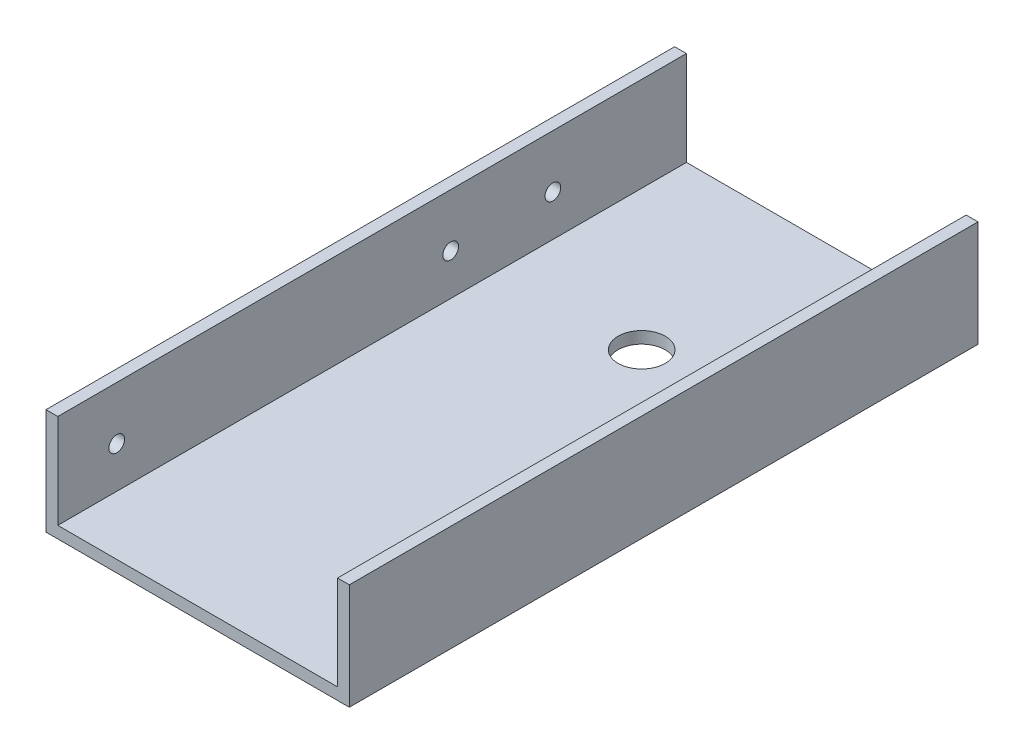
ISO-10303-21;
HEADER;
FILE_DESCRIPTION(('STEP AP214'),'2;1');
FILE_NAME('part.step','',(''),(''),'','','');
FILE_SCHEMA(('AUTOMOTIVE_DESIGN { 1 0 10303 214 1 1 1 1 }'));
ENDSEC;
DATA;
#1=APPLICATION_CONTEXT('core data for automotive mechanical design processes');
#2=APPLICATION_PROTOCOL_DEFINITION('international standard','automotive_design',2000,#1);
#3=PRODUCT_CONTEXT('',#1,'mechanical');
#4=PRODUCT('Part','Part','',(#3));
#5=PRODUCT_RELATED_PRODUCT_CATEGORY('part','',(#4));
#6=PRODUCT_DEFINITION_FORMATION('','',#4);
#7=PRODUCT_DEFINITION_CONTEXT('part definition',#1,'design');
#8=PRODUCT_DEFINITION('design','',#6,#7);
#9=PRODUCT_DEFINITION_SHAPE('','',#8);
#10=(LENGTH_UNIT() NAMED_UNIT(*) SI_UNIT(.MILLI.,.METRE.));
#11=(NAMED_UNIT(*) PLANE_ANGLE_UNIT() SI_UNIT($,.RADIAN.));
#12=(NAMED_UNIT(*) SI_UNIT($,.STERADIAN.) SOLID_ANGLE_UNIT());
#13=UNCERTAINTY_MEASURE_WITH_UNIT(LENGTH_MEASURE(1.E-05),#10,'distance_accuracy_value','');
#14=(GEOMETRIC_REPRESENTATION_CONTEXT(3) GLOBAL_UNCERTAINTY_ASSIGNED_CONTEXT((#13)) GLOBAL_UNIT_ASSIGNED_CONTEXT((#10,
#11,#12)) REPRESENTATION_CONTEXT('',''));
#15=CARTESIAN_POINT('',(0.,0.,0.));
#16=DIRECTION('',(0.,0.,1.));
#17=DIRECTION('',(1.,0.,0.));
#18=AXIS2_PLACEMENT_3D('',#15,#16,#17);
#19=CARTESIAN_POINT('',(-19.3,13.5,40.));
#20=DIRECTION('',(0.,-1.,0.));
#21=DIRECTION('',(0.,0.,-1.));
#22=AXIS2_PLACEMENT_3D('',#19,#20,#21);
#23=PLANE('',#22);
#24=DIRECTION('',(-1.,0.,0.));
#25=VECTOR('',#24,1.);
#26=CARTESIAN_POINT('',(-19.3,13.5,-40.));
#27=LINE('',#26,#25);
#28=CARTESIAN_POINT('',(-17.8,13.5,-40.));
#29=VERTEX_POINT('',#28);
#30=CARTESIAN_POINT('',(-19.3,13.5,-40.));
#31=VERTEX_POINT('',#30);
#32=EDGE_CURVE('E114',#29,#31,#27,.T.);
#33=ORIENTED_EDGE('',*,*,#32,.T.);
#34=DIRECTION('',(0.,0.,-1.));
#35=VECTOR('',#34,1.);
#36=CARTESIAN_POINT('',(-19.3,13.5,40.));
#37=LINE('',#36,#35);
#38=CARTESIAN_POINT('',(-19.3,13.5,40.));
#39=VERTEX_POINT('',#38);
#40=EDGE_CURVE('E25',#39,#31,#37,.T.);
#41=ORIENTED_EDGE('',*,*,#40,.F.);
#42=DIRECTION('',(-1.,0.,0.));
#43=VECTOR('',#42,1.);
#44=CARTESIAN_POINT('',(-19.3,13.5,40.));
#45=LINE('',#44,#43);
#46=CARTESIAN_POINT('',(-17.8,13.5,40.));
#47=VERTEX_POINT('',#46);
#48=EDGE_CURVE('E129',#47,#39,#45,.T.);
#49=ORIENTED_EDGE('',*,*,#48,.F.);
#50=DIRECTION('',(0.,0.,-1.));
#51=VECTOR('',#50,1.);
#52=CARTESIAN_POINT('',(-17.8,13.5,40.));
#53=LINE('',#52,#51);
#54=EDGE_CURVE('E110',#47,#29,#53,.T.);
#55=ORIENTED_EDGE('',*,*,#54,.T.);
#56=EDGE_LOOP('',(#33,#41,#49,#55));
#57=FACE_BOUND('',#56,.T.);
#58=ADVANCED_FACE('F17',(#57),#23,.F.);
#59=CARTESIAN_POINT('',(-19.3,13.5,40.));
#60=DIRECTION('',(1.,0.,0.));
#61=DIRECTION('',(0.,1.,0.));
#62=AXIS2_PLACEMENT_3D('',#59,#60,#61);
#63=PLANE('',#62);
#64=CARTESIAN_POINT('',(-19.3,6.75,32.5));
#65=DIRECTION('',(-1.,0.,0.));
#66=DIRECTION('',(0.,-1.,0.));
#67=AXIS2_PLACEMENT_3D('',#64,#65,#66);
#68=CIRCLE('',#67,1.);
#69=CARTESIAN_POINT('',(-19.3,5.75,32.5));
#70=VERTEX_POINT('',#69);
#71=EDGE_CURVE('E374',#70,#70,#68,.T.);
#72=ORIENTED_EDGE('',*,*,#71,.F.);
#73=EDGE_LOOP('',(#72));
#74=FACE_BOUND('',#73,.T.);
#75=CARTESIAN_POINT('',(-19.3,6.75,-10.));
#76=DIRECTION('',(-1.,0.,0.));
#77=DIRECTION('',(0.,-1.,0.));
#78=AXIS2_PLACEMENT_3D('',#75,#76,#77);
#79=CIRCLE('',#78,1.);
#80=CARTESIAN_POINT('',(-19.3,5.75,-10.));
#81=VERTEX_POINT('',#80);
#82=EDGE_CURVE('E382',#81,#81,#79,.T.);
#83=ORIENTED_EDGE('',*,*,#82,.F.);
#84=EDGE_LOOP('',(#83));
#85=FACE_BOUND('',#84,.T.);
#86=CARTESIAN_POINT('',(-19.3,6.75,-23.));
#87=DIRECTION('',(-1.,0.,0.));
#88=DIRECTION('',(0.,-1.,0.));
#89=AXIS2_PLACEMENT_3D('',#86,#87,#88);
#90=CIRCLE('',#89,1.);
#91=CARTESIAN_POINT('',(-19.3,5.75,-23.));
#92=VERTEX_POINT('',#91);
#93=EDGE_CURVE('E147',#92,#92,#90,.T.);
#94=ORIENTED_EDGE('',*,*,#93,.F.);
#95=EDGE_LOOP('',(#94));
#96=FACE_BOUND('',#95,.T.);
#97=DIRECTION('',(0.,-1.,0.));
#98=VECTOR('',#97,1.);
#99=CARTESIAN_POINT('',(-19.3,13.5,-40.));
#100=LINE('',#99,#98);
#101=CARTESIAN_POINT('',(-19.3,0.,-40.));
#102=VERTEX_POINT('',#101);
#103=EDGE_CURVE('E117',#31,#102,#100,.T.);
#104=ORIENTED_EDGE('',*,*,#103,.T.);
#105=DIRECTION('',(0.,0.,-1.));
#106=VECTOR('',#105,1.);
#107=CARTESIAN_POINT('',(-19.3,0.,40.));
#108=LINE('',#107,#106);
#109=CARTESIAN_POINT('',(-19.3,0.,40.));
#110=VERTEX_POINT('',#109);
#111=EDGE_CURVE('E139',#110,#102,#108,.T.);
#112=ORIENTED_EDGE('',*,*,#111,.F.);
#113=DIRECTION('',(0.,-1.,0.));
#114=VECTOR('',#113,1.);
#115=CARTESIAN_POINT('',(-19.3,13.5,40.));
#116=LINE('',#115,#114);
#117=EDGE_CURVE('E77',#39,#110,#116,.T.);
#118=ORIENTED_EDGE('',*,*,#117,.F.);
#119=ORIENTED_EDGE('',*,*,#40,.T.);
#120=EDGE_LOOP('',(#104,#112,#118,#119));
#121=FACE_BOUND('',#120,.T.);
#122=ADVANCED_FACE('F193',(#74,#85,#96,#121),#63,.F.);
#123=CARTESIAN_POINT('',(-19.3,0.,40.));
#124=DIRECTION('',(0.,1.,0.));
#125=DIRECTION('',(0.,0.,1.));
#126=AXIS2_PLACEMENT_3D('',#123,#124,#125);
#127=PLANE('',#126);
#128=CARTESIAN_POINT('',(0.,0.,16.5));
#129=DIRECTION('',(0.,1.,0.));
#130=DIRECTION('',(0.,0.,1.));
#131=AXIS2_PLACEMENT_3D('',#128,#129,#130);
#132=CIRCLE('',#131,2.85);
#133=CARTESIAN_POINT('',(0.,0.,19.35));
#134=VERTEX_POINT('',#133);
#135=EDGE_CURVE('E11',#134,#134,#132,.F.);
#136=ORIENTED_EDGE('',*,*,#135,.F.);
#137=EDGE_LOOP('',(#136));
#138=FACE_BOUND('',#137,.T.);
#139=CARTESIAN_POINT('',(0.,0.,-16.5));
#140=DIRECTION('',(0.,-1.,0.));
#141=DIRECTION('',(0.,0.,-1.));
#142=AXIS2_PLACEMENT_3D('',#139,#140,#141);
#143=CIRCLE('',#142,3.);
#144=CARTESIAN_POINT('',(0.,0.,-19.5));
#145=VERTEX_POINT('',#144);
#146=EDGE_CURVE('E143',#145,#145,#143,.T.);
#147=ORIENTED_EDGE('',*,*,#146,.F.);
#148=EDGE_LOOP('',(#147));
#149=FACE_BOUND('',#148,.T.);
#150=DIRECTION('',(1.,0.,0.));
#151=VECTOR('',#150,1.);
#152=CARTESIAN_POINT('',(-19.3,0.,-40.));
#153=LINE('',#152,#151);
#154=CARTESIAN_POINT('',(19.3,0.,-40.));
#155=VERTEX_POINT('',#154);
#156=EDGE_CURVE('E120',#102,#155,#153,.T.);
#157=ORIENTED_EDGE('',*,*,#156,.T.);
#158=DIRECTION('',(0.,0.,-1.));
#159=VECTOR('',#158,1.);
#160=CARTESIAN_POINT('',(19.3,0.,40.));
#161=LINE('',#160,#159);
#162=CARTESIAN_POINT('',(19.3,0.,40.));
#163=VERTEX_POINT('',#162);
#164=EDGE_CURVE('E136',#163,#155,#161,.T.);
#165=ORIENTED_EDGE('',*,*,#164,.F.);
#166=DIRECTION('',(1.,0.,0.));
#167=VECTOR('',#166,1.);
#168=CARTESIAN_POINT('',(-19.3,0.,40.));
#169=LINE('',#168,#167);
#170=EDGE_CURVE('E158',#110,#163,#169,.T.);
#171=ORIENTED_EDGE('',*,*,#170,.F.);
#172=ORIENTED_EDGE('',*,*,#111,.T.);
#173=EDGE_LOOP('',(#157,#165,#171,#172));
#174=FACE_BOUND('',#173,.T.);
#175=ADVANCED_FACE('F197',(#138,#149,#174),#127,.F.);
#176=CARTESIAN_POINT('',(19.3,0.,40.));
#177=DIRECTION('',(-1.,0.,0.));
#178=DIRECTION('',(0.,-1.,0.));
#179=AXIS2_PLACEMENT_3D('',#176,#177,#178);
#180=PLANE('',#179);
#181=DIRECTION('',(0.,1.,0.));
#182=VECTOR('',#181,1.);
#183=CARTESIAN_POINT('',(19.3,0.,-40.));
#184=LINE('',#183,#182);
#185=CARTESIAN_POINT('',(19.3,13.5,-40.));
#186=VERTEX_POINT('',#185);
#187=EDGE_CURVE('E122',#155,#186,#184,.T.);
#188=ORIENTED_EDGE('',*,*,#187,.T.);
#189=DIRECTION('',(0.,0.,-1.));
#190=VECTOR('',#189,1.);
#191=CARTESIAN_POINT('',(19.3,13.5,40.));
#192=LINE('',#191,#190);
#193=CARTESIAN_POINT('',(19.3,13.5,40.));
#194=VERTEX_POINT('',#193);
#195=EDGE_CURVE('E133',#194,#186,#192,.T.);
#196=ORIENTED_EDGE('',*,*,#195,.F.);
#197=DIRECTION('',(0.,1.,0.));
#198=VECTOR('',#197,1.);
#199=CARTESIAN_POINT('',(19.3,0.,40.));
#200=LINE('',#199,#198);
#201=EDGE_CURVE('E160',#163,#194,#200,.T.);
#202=ORIENTED_EDGE('',*,*,#201,.F.);
#203=ORIENTED_EDGE('',*,*,#164,.T.);
#204=EDGE_LOOP('',(#188,#196,#202,#203));
#205=FACE_BOUND('',#204,.T.);
#206=ADVANCED_FACE('F166',(#205),#180,.F.);
#207=CARTESIAN_POINT('',(17.8,13.5,40.));
#208=DIRECTION('',(0.,-1.,0.));
#209=DIRECTION('',(0.,0.,-1.));
#210=AXIS2_PLACEMENT_3D('',#207,#208,#209);
#211=PLANE('',#210);
#212=DIRECTION('',(-1.,0.,0.));
#213=VECTOR('',#212,1.);
#214=CARTESIAN_POINT('',(17.8,13.5,-40.));
#215=LINE('',#214,#213);
#216=CARTESIAN_POINT('',(17.8,13.5,-40.));
#217=VERTEX_POINT('',#216);
#218=EDGE_CURVE('E124',#186,#217,#215,.T.);
#219=ORIENTED_EDGE('',*,*,#218,.T.);
#220=DIRECTION('',(0.,0.,-1.));
#221=VECTOR('',#220,1.);
#222=CARTESIAN_POINT('',(17.8,13.5,40.));
#223=LINE('',#222,#221);
#224=CARTESIAN_POINT('',(17.8,13.5,40.));
#225=VERTEX_POINT('',#224);
#226=EDGE_CURVE('E105',#225,#217,#223,.T.);
#227=ORIENTED_EDGE('',*,*,#226,.F.);
#228=DIRECTION('',(-1.,0.,0.));
#229=VECTOR('',#228,1.);
#230=CARTESIAN_POINT('',(17.8,13.5,40.));
#231=LINE('',#230,#229);
#232=EDGE_CURVE('E96',#194,#225,#231,.T.);
#233=ORIENTED_EDGE('',*,*,#232,.F.);
#234=ORIENTED_EDGE('',*,*,#195,.T.);
#235=EDGE_LOOP('',(#219,#227,#233,#234));
#236=FACE_BOUND('',#235,.T.);
#237=ADVANCED_FACE('F170',(#236),#211,.F.);
#238=CARTESIAN_POINT('',(17.8,1.5,40.));
#239=DIRECTION('',(1.,0.,0.));
#240=DIRECTION('',(0.,0.,-1.));
#241=AXIS2_PLACEMENT_3D('',#238,#239,#240);
#242=PLANE('',#241);
#243=DIRECTION('',(0.,-1.,0.));
#244=VECTOR('',#243,1.);
#245=CARTESIAN_POINT('',(17.8,1.5,-40.));
#246=LINE('',#245,#244);
#247=CARTESIAN_POINT('',(17.8,1.5,-40.));
#248=VERTEX_POINT('',#247);
#249=EDGE_CURVE('E104',#217,#248,#246,.T.);
#250=ORIENTED_EDGE('',*,*,#249,.T.);
#251=DIRECTION('',(0.,0.,-1.));
#252=VECTOR('',#251,1.);
#253=CARTESIAN_POINT('',(17.8,1.5,40.));
#254=LINE('',#253,#252);
#255=CARTESIAN_POINT('',(17.8,1.5,40.));
#256=VERTEX_POINT('',#255);
#257=EDGE_CURVE('E101',#256,#248,#254,.T.);
#258=ORIENTED_EDGE('',*,*,#257,.F.);
#259=DIRECTION('',(0.,-1.,0.));
#260=VECTOR('',#259,1.);
#261=CARTESIAN_POINT('',(17.8,1.5,40.));
#262=LINE('',#261,#260);
#263=EDGE_CURVE('E90',#225,#256,#262,.T.);
#264=ORIENTED_EDGE('',*,*,#263,.F.);
#265=ORIENTED_EDGE('',*,*,#226,.T.);
#266=EDGE_LOOP('',(#250,#258,#264,#265));
#267=FACE_BOUND('',#266,.T.);
#268=ADVANCED_FACE('F102',(#267),#242,.F.);
#269=CARTESIAN_POINT('',(-17.8,1.5,40.));
#270=DIRECTION('',(0.,-1.,0.));
#271=DIRECTION('',(0.,0.,-1.));
#272=AXIS2_PLACEMENT_3D('',#269,#270,#271);
#273=PLANE('',#272);
#274=CARTESIAN_POINT('',(0.,1.5,-16.5));
#275=DIRECTION('',(0.,-1.,0.));
#276=DIRECTION('',(0.,0.,-1.));
#277=AXIS2_PLACEMENT_3D('',#274,#275,#276);
#278=CIRCLE('',#277,3.);
#279=CARTESIAN_POINT('',(0.,1.5,-19.5));
#280=VERTEX_POINT('',#279);
#281=EDGE_CURVE('E118',#280,#280,#278,.T.);
#282=ORIENTED_EDGE('',*,*,#281,.T.);
#283=EDGE_LOOP('',(#282));
#284=FACE_BOUND('',#283,.T.);
#285=DIRECTION('',(-1.,0.,0.));
#286=VECTOR('',#285,1.);
#287=CARTESIAN_POINT('',(-17.8,1.5,-40.));
#288=LINE('',#287,#286);
#289=CARTESIAN_POINT('',(-17.8,1.5,-40.));
#290=VERTEX_POINT('',#289);
#291=EDGE_CURVE('E62',#248,#290,#288,.T.);
#292=ORIENTED_EDGE('',*,*,#291,.T.);
#293=DIRECTION('',(0.,0.,-1.));
#294=VECTOR('',#293,1.);
#295=CARTESIAN_POINT('',(-17.8,1.5,40.));
#296=LINE('',#295,#294);
#297=CARTESIAN_POINT('',(-17.8,1.5,40.));
#298=VERTEX_POINT('',#297);
#299=EDGE_CURVE('E106',#298,#290,#296,.T.);
#300=ORIENTED_EDGE('',*,*,#299,.F.);
#301=DIRECTION('',(-1.,0.,0.));
#302=VECTOR('',#301,1.);
#303=CARTESIAN_POINT('',(-17.8,1.5,40.));
#304=LINE('',#303,#302);
#305=EDGE_CURVE('E94',#256,#298,#304,.T.);
#306=ORIENTED_EDGE('',*,*,#305,.F.);
#307=ORIENTED_EDGE('',*,*,#257,.T.);
#308=EDGE_LOOP('',(#292,#300,#306,#307));
#309=FACE_BOUND('',#308,.T.);
#310=ADVANCED_FACE('F108',(#284,#309),#273,.F.);
#311=CARTESIAN_POINT('',(-17.8,13.5,40.));
#312=DIRECTION('',(-1.,0.,0.));
#313=DIRECTION('',(0.,0.,1.));
#314=AXIS2_PLACEMENT_3D('',#311,#312,#313);
#315=PLANE('',#314);
#316=CARTESIAN_POINT('',(-17.8,6.75,32.5));
#317=DIRECTION('',(-1.,0.,0.));
#318=DIRECTION('',(0.,0.,1.));
#319=AXIS2_PLACEMENT_3D('',#316,#317,#318);
#320=CIRCLE('',#319,1.);
#321=CARTESIAN_POINT('',(-17.8,6.75,33.5));
#322=VERTEX_POINT('',#321);
#323=EDGE_CURVE('E371',#322,#322,#320,.F.);
#324=ORIENTED_EDGE('',*,*,#323,.F.);
#325=EDGE_LOOP('',(#324));
#326=FACE_BOUND('',#325,.T.);
#327=CARTESIAN_POINT('',(-17.8,6.75,-10.));
#328=DIRECTION('',(-1.,0.,0.));
#329=DIRECTION('',(0.,0.,1.));
#330=AXIS2_PLACEMENT_3D('',#327,#328,#329);
#331=CIRCLE('',#330,1.);
#332=CARTESIAN_POINT('',(-17.8,6.75,-9.));
#333=VERTEX_POINT('',#332);
#334=EDGE_CURVE('E379',#333,#333,#331,.F.);
#335=ORIENTED_EDGE('',*,*,#334,.F.);
#336=EDGE_LOOP('',(#335));
#337=FACE_BOUND('',#336,.T.);
#338=CARTESIAN_POINT('',(-17.8,6.75,-23.));
#339=DIRECTION('',(-1.,0.,0.));
#340=DIRECTION('',(0.,0.,1.));
#341=AXIS2_PLACEMENT_3D('',#338,#339,#340);
#342=CIRCLE('',#341,1.);
#343=CARTESIAN_POINT('',(-17.8,6.75,-22.));
#344=VERTEX_POINT('',#343);
#345=EDGE_CURVE('E152',#344,#344,#342,.F.);
#346=ORIENTED_EDGE('',*,*,#345,.F.);
#347=EDGE_LOOP('',(#346));
#348=FACE_BOUND('',#347,.T.);
#349=DIRECTION('',(0.,1.,0.));
#350=VECTOR('',#349,1.);
#351=CARTESIAN_POINT('',(-17.8,13.5,-40.));
#352=LINE('',#351,#350);
#353=EDGE_CURVE('E68',#290,#29,#352,.T.);
#354=ORIENTED_EDGE('',*,*,#353,.T.);
#355=ORIENTED_EDGE('',*,*,#54,.F.);
#356=DIRECTION('',(0.,1.,0.));
#357=VECTOR('',#356,1.);
#358=CARTESIAN_POINT('',(-17.8,13.5,40.));
#359=LINE('',#358,#357);
#360=EDGE_CURVE('E33',#298,#47,#359,.T.);
#361=ORIENTED_EDGE('',*,*,#360,.F.);
#362=ORIENTED_EDGE('',*,*,#299,.T.);
#363=EDGE_LOOP('',(#354,#355,#361,#362));
#364=FACE_BOUND('',#363,.T.);
#365=ADVANCED_FACE('F178',(#326,#337,#348,#364),#315,.F.);
#366=CARTESIAN_POINT('',(0.,0.,40.));
#367=DIRECTION('',(0.,0.,-1.));
#368=DIRECTION('',(-1.,0.,0.));
#369=AXIS2_PLACEMENT_3D('',#366,#367,#368);
#370=PLANE('',#369);
#371=ORIENTED_EDGE('',*,*,#48,.T.);
#372=ORIENTED_EDGE('',*,*,#117,.T.);
#373=ORIENTED_EDGE('',*,*,#170,.T.);
#374=ORIENTED_EDGE('',*,*,#201,.T.);
#375=ORIENTED_EDGE('',*,*,#232,.T.);
#376=ORIENTED_EDGE('',*,*,#263,.T.);
#377=ORIENTED_EDGE('',*,*,#305,.T.);
#378=ORIENTED_EDGE('',*,*,#360,.T.);
#379=EDGE_LOOP('',(#371,#372,#373,#374,#375,#376,#377,#378));
#380=FACE_BOUND('',#379,.T.);
#381=ADVANCED_FACE('F92',(#380),#370,.F.);
#382=CARTESIAN_POINT('',(0.,0.,-40.));
#383=DIRECTION('',(0.,0.,-1.));
#384=DIRECTION('',(-1.,0.,0.));
#385=AXIS2_PLACEMENT_3D('',#382,#383,#384);
#386=PLANE('',#385);
#387=ORIENTED_EDGE('',*,*,#32,.F.);
#388=ORIENTED_EDGE('',*,*,#353,.F.);
#389=ORIENTED_EDGE('',*,*,#291,.F.);
#390=ORIENTED_EDGE('',*,*,#249,.F.);
#391=ORIENTED_EDGE('',*,*,#218,.F.);
#392=ORIENTED_EDGE('',*,*,#187,.F.);
#393=ORIENTED_EDGE('',*,*,#156,.F.);
#394=ORIENTED_EDGE('',*,*,#103,.F.);
#395=EDGE_LOOP('',(#387,#388,#389,#390,#391,#392,#393,#394));
#396=FACE_BOUND('',#395,.T.);
#397=ADVANCED_FACE('F173',(#396),#386,.T.);
#398=CARTESIAN_POINT('',(0.,13.5,-16.5));
#399=DIRECTION('',(0.,-1.,0.));
#400=DIRECTION('',(0.,0.,-1.));
#401=AXIS2_PLACEMENT_3D('',#398,#399,#400);
#402=CYLINDRICAL_SURFACE('',#401,3.);
#403=ORIENTED_EDGE('',*,*,#146,.T.);
#404=EDGE_LOOP('',(#403));
#405=FACE_BOUND('',#404,.T.);
#406=ORIENTED_EDGE('',*,*,#281,.F.);
#407=EDGE_LOOP('',(#406));
#408=FACE_BOUND('',#407,.T.);
#409=ADVANCED_FACE('F251',(#405,#408),#402,.F.);
#410=CARTESIAN_POINT('',(19.301,6.75,-23.));
#411=DIRECTION('',(-1.,0.,0.));
#412=DIRECTION('',(0.,-1.,0.));
#413=AXIS2_PLACEMENT_3D('',#410,#411,#412);
#414=CYLINDRICAL_SURFACE('',#413,1.);
#415=ORIENTED_EDGE('',*,*,#93,.T.);
#416=EDGE_LOOP('',(#415));
#417=FACE_BOUND('',#416,.T.);
#418=ORIENTED_EDGE('',*,*,#345,.T.);
#419=EDGE_LOOP('',(#418));
#420=FACE_BOUND('',#419,.T.);
#421=ADVANCED_FACE('F261',(#417,#420),#414,.F.);
#422=CARTESIAN_POINT('',(19.301,6.75,-10.));
#423=DIRECTION('',(-1.,0.,0.));
#424=DIRECTION('',(0.,-1.,0.));
#425=AXIS2_PLACEMENT_3D('',#422,#423,#424);
#426=CYLINDRICAL_SURFACE('',#425,1.);
#427=ORIENTED_EDGE('',*,*,#82,.T.);
#428=EDGE_LOOP('',(#427));
#429=FACE_BOUND('',#428,.T.);
#430=ORIENTED_EDGE('',*,*,#334,.T.);
#431=EDGE_LOOP('',(#430));
#432=FACE_BOUND('',#431,.T.);
#433=ADVANCED_FACE('F271',(#429,#432),#426,.F.);
#434=CARTESIAN_POINT('',(19.301,6.75,32.5));
#435=DIRECTION('',(-1.,0.,0.));
#436=DIRECTION('',(0.,-1.,0.));
#437=AXIS2_PLACEMENT_3D('',#434,#435,#436);
#438=CYLINDRICAL_SURFACE('',#437,1.);
#439=ORIENTED_EDGE('',*,*,#71,.T.);
#440=EDGE_LOOP('',(#439));
#441=FACE_BOUND('',#440,.T.);
#442=ORIENTED_EDGE('',*,*,#323,.T.);
#443=EDGE_LOOP('',(#442));
#444=FACE_BOUND('',#443,.T.);
#445=ADVANCED_FACE('F282',(#441,#444),#438,.F.);
#446=CARTESIAN_POINT('',(0.,-3.5,16.5));
#447=DIRECTION('',(0.,1.,0.));
#448=DIRECTION('',(0.,0.,1.));
#449=AXIS2_PLACEMENT_3D('',#446,#447,#448);
#450=CYLINDRICAL_SURFACE('',#449,2.85);
#451=CARTESIAN_POINT('',(0.,-3.5,16.5));
#452=DIRECTION('',(0.,-1.,0.));
#453=DIRECTION('',(0.,0.,-1.));
#454=AXIS2_PLACEMENT_3D('',#451,#452,#453);
#455=CIRCLE('',#454,2.85);
#456=CARTESIAN_POINT('',(0.,-3.5,13.65));
#457=VERTEX_POINT('',#456);
#458=EDGE_CURVE('E370',#457,#457,#455,.T.);
#459=ORIENTED_EDGE('',*,*,#458,.F.);
#460=EDGE_LOOP('',(#459));
#461=FACE_BOUND('',#460,.T.);
#462=ORIENTED_EDGE('',*,*,#135,.T.);
#463=EDGE_LOOP('',(#462));
#464=FACE_BOUND('',#463,.T.);
#465=ADVANCED_FACE('F293',(#461,#464),#450,.T.);
#466=CARTESIAN_POINT('',(0.,-3.5,16.5));
#467=DIRECTION('',(0.,-1.,0.));
#468=DIRECTION('',(0.,0.,-1.));
#469=AXIS2_PLACEMENT_3D('',#466,#467,#468);
#470=PLANE('',#469);
#471=ORIENTED_EDGE('',*,*,#458,.T.);
#472=EDGE_LOOP('',(#471));
#473=FACE_BOUND('',#472,.T.);
#474=ADVANCED_FACE('F304',(#473),#470,.T.);
#475=CLOSED_SHELL('',(#58,#122,#175,#206,#237,#268,#310,#365,#381,#397,#409,#421,#433,#445,#465,#474));
#476=MANIFOLD_SOLID_BREP('B1',#475);
#477=ADVANCED_BREP_SHAPE_REPRESENTATION('',(#18,#476),#14);
#478=SHAPE_DEFINITION_REPRESENTATION(#9,#477);
ENDSEC;
END-ISO-10303-21;
